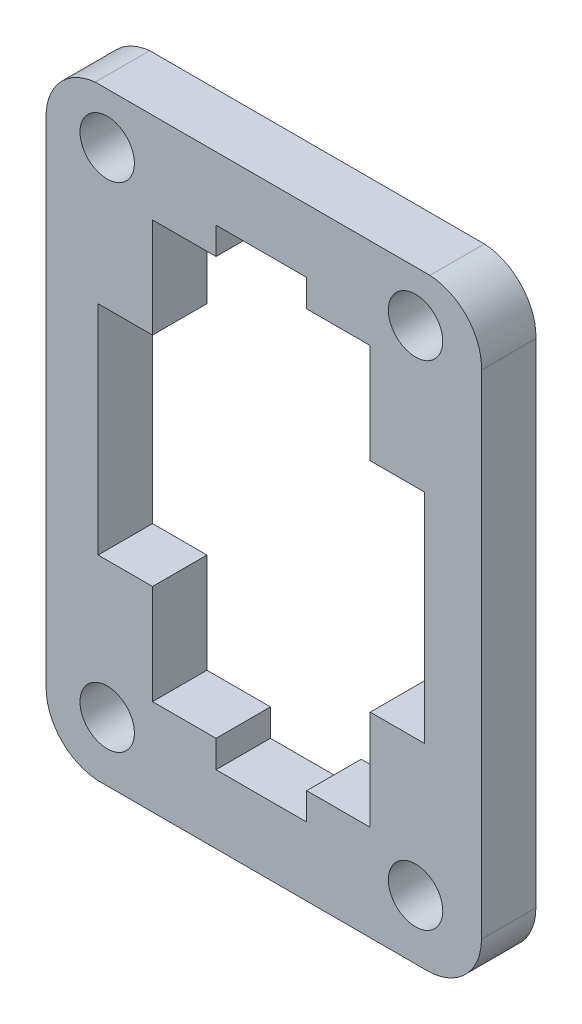
ISO-10303-21;
HEADER;
FILE_DESCRIPTION(('STEP AP214'),'2;1');
FILE_NAME('part.step','',(''),(''),'','','');
FILE_SCHEMA(('AUTOMOTIVE_DESIGN { 1 0 10303 214 1 1 1 1 }'));
ENDSEC;
DATA;
#1=APPLICATION_CONTEXT('core data for automotive mechanical design processes');
#2=APPLICATION_PROTOCOL_DEFINITION('international standard','automotive_design',2000,#1);
#3=PRODUCT_CONTEXT('',#1,'mechanical');
#4=PRODUCT('Part','Part','',(#3));
#5=PRODUCT_RELATED_PRODUCT_CATEGORY('part','',(#4));
#6=PRODUCT_DEFINITION_FORMATION('','',#4);
#7=PRODUCT_DEFINITION_CONTEXT('part definition',#1,'design');
#8=PRODUCT_DEFINITION('design','',#6,#7);
#9=PRODUCT_DEFINITION_SHAPE('','',#8);
#10=(LENGTH_UNIT() NAMED_UNIT(*) SI_UNIT(.MILLI.,.METRE.));
#11=(NAMED_UNIT(*) PLANE_ANGLE_UNIT() SI_UNIT($,.RADIAN.));
#12=(NAMED_UNIT(*) SI_UNIT($,.STERADIAN.) SOLID_ANGLE_UNIT());
#13=UNCERTAINTY_MEASURE_WITH_UNIT(LENGTH_MEASURE(1.E-05),#10,'distance_accuracy_value','');
#14=(GEOMETRIC_REPRESENTATION_CONTEXT(3) GLOBAL_UNCERTAINTY_ASSIGNED_CONTEXT((#13)) GLOBAL_UNIT_ASSIGNED_CONTEXT((#10,
#11,#12)) REPRESENTATION_CONTEXT('',''));
#15=CARTESIAN_POINT('',(0.,0.,0.));
#16=DIRECTION('',(0.,0.,1.));
#17=DIRECTION('',(1.,0.,0.));
#18=AXIS2_PLACEMENT_3D('',#15,#16,#17);
#19=CARTESIAN_POINT('',(41.133407433451,27.2260168239885,3.));
#20=CARTESIAN_POINT('',(41.133407433451,26.4304168239885,3.));
#21=CARTESIAN_POINT('',(41.449407433451,25.6674168239885,3.));
#22=CARTESIAN_POINT('',(42.012007433451,25.1048168239885,3.));
#23=B_SPLINE_CURVE_WITH_KNOTS('',3,(#19,#20,#21,#22),.UNSPECIFIED.,.F.,.F.,(4,4),(0.,
0.333333333333333),.UNSPECIFIED.);
#24=DIRECTION('',(0.,0.,-1.));
#25=VECTOR('',#24,1.);
#26=SURFACE_OF_LINEAR_EXTRUSION('',#23,#25);
#27=CARTESIAN_POINT('',(41.133407433451,27.2260168239885,0.));
#28=CARTESIAN_POINT('',(41.133407433451,26.4304168239885,0.));
#29=CARTESIAN_POINT('',(41.449407433451,25.6674168239885,0.));
#30=CARTESIAN_POINT('',(42.012007433451,25.1048168239885,0.));
#31=B_SPLINE_CURVE_WITH_KNOTS('',3,(#27,#28,#29,#30),.UNSPECIFIED.,.F.,.F.,(4,4),(0.,
0.333333333333333),.UNSPECIFIED.);
#32=CARTESIAN_POINT('',(41.133407433451,27.2260168239885,0.));
#33=VERTEX_POINT('',#32);
#34=CARTESIAN_POINT('',(42.012007433451,25.1048168239885,0.));
#35=VERTEX_POINT('',#34);
#36=EDGE_CURVE('E335',#33,#35,#31,.T.);
#37=ORIENTED_EDGE('',*,*,#36,.T.);
#38=DIRECTION('',(0.,0.,-1.));
#39=VECTOR('',#38,1.);
#40=CARTESIAN_POINT('',(42.012007433451,25.1048168239885,3.));
#41=LINE('',#40,#39);
#42=CARTESIAN_POINT('',(42.012007433451,25.1048168239885,3.));
#43=VERTEX_POINT('',#42);
#44=EDGE_CURVE('E11',#43,#35,#41,.T.);
#45=ORIENTED_EDGE('',*,*,#44,.F.);
#46=CARTESIAN_POINT('',(41.133407433451,27.2260168239885,3.));
#47=VERTEX_POINT('',#46);
#48=EDGE_CURVE('E565',#47,#43,#23,.T.);
#49=ORIENTED_EDGE('',*,*,#48,.F.);
#50=DIRECTION('',(0.,0.,-1.));
#51=VECTOR('',#50,1.);
#52=CARTESIAN_POINT('',(41.133407433451,27.2260168239885,3.));
#53=LINE('',#52,#51);
#54=EDGE_CURVE('E365',#47,#33,#53,.T.);
#55=ORIENTED_EDGE('',*,*,#54,.T.);
#56=EDGE_LOOP('',(#37,#45,#49,#55));
#57=FACE_BOUND('',#56,.T.);
#58=ADVANCED_FACE('F35',(#57),#26,.F.);
#59=CARTESIAN_POINT('',(42.012007433451,25.1048168239885,3.));
#60=CARTESIAN_POINT('',(42.574607433451,24.5422168239885,3.));
#61=CARTESIAN_POINT('',(43.3377074334511,24.2260168239885,3.));
#62=CARTESIAN_POINT('',(44.133407433451,24.2260168239884,3.));
#63=B_SPLINE_CURVE_WITH_KNOTS('',3,(#59,#60,#61,#62),.UNSPECIFIED.,.F.,.F.,(4,4),
(0.333333333333333,1.),.UNSPECIFIED.);
#64=DIRECTION('',(0.,0.,-1.));
#65=VECTOR('',#64,1.);
#66=SURFACE_OF_LINEAR_EXTRUSION('',#63,#65);
#67=CARTESIAN_POINT('',(42.012007433451,25.1048168239885,0.));
#68=CARTESIAN_POINT('',(42.574607433451,24.5422168239885,0.));
#69=CARTESIAN_POINT('',(43.3377074334511,24.2260168239885,0.));
#70=CARTESIAN_POINT('',(44.133407433451,24.2260168239884,0.));
#71=B_SPLINE_CURVE_WITH_KNOTS('',3,(#67,#68,#69,#70),.UNSPECIFIED.,.F.,.F.,(4,4),
(0.333333333333333,1.),.UNSPECIFIED.);
#72=CARTESIAN_POINT('',(44.133407433451,24.2260168239884,0.));
#73=VERTEX_POINT('',#72);
#74=EDGE_CURVE('E340',#35,#73,#71,.T.);
#75=ORIENTED_EDGE('',*,*,#74,.T.);
#76=DIRECTION('',(0.,0.,-1.));
#77=VECTOR('',#76,1.);
#78=CARTESIAN_POINT('',(44.133407433451,24.2260168239884,3.));
#79=LINE('',#78,#77);
#80=CARTESIAN_POINT('',(44.133407433451,24.2260168239884,3.));
#81=VERTEX_POINT('',#80);
#82=EDGE_CURVE('E45',#81,#73,#79,.T.);
#83=ORIENTED_EDGE('',*,*,#82,.F.);
#84=EDGE_CURVE('E570',#43,#81,#63,.T.);
#85=ORIENTED_EDGE('',*,*,#84,.F.);
#86=ORIENTED_EDGE('',*,*,#44,.T.);
#87=EDGE_LOOP('',(#75,#83,#85,#86));
#88=FACE_BOUND('',#87,.T.);
#89=ADVANCED_FACE('F582',(#88),#66,.F.);
#90=CARTESIAN_POINT('',(0.,24.2260168239884,3.));
#91=DIRECTION('',(0.,1.,0.));
#92=DIRECTION('',(0.,0.,1.));
#93=AXIS2_PLACEMENT_3D('',#90,#91,#92);
#94=PLANE('',#93);
#95=DIRECTION('',(1.,0.,0.));
#96=VECTOR('',#95,1.);
#97=CARTESIAN_POINT('',(0.,24.2260168239884,0.));
#98=LINE('',#97,#96);
#99=CARTESIAN_POINT('',(62.133207433451,24.2260168239884,0.));
#100=VERTEX_POINT('',#99);
#101=EDGE_CURVE('E347',#73,#100,#98,.T.);
#102=ORIENTED_EDGE('',*,*,#101,.T.);
#103=DIRECTION('',(0.,0.,-1.));
#104=VECTOR('',#103,1.);
#105=CARTESIAN_POINT('',(62.133207433451,24.2260168239884,3.));
#106=LINE('',#105,#104);
#107=CARTESIAN_POINT('',(62.133207433451,24.2260168239884,3.));
#108=VERTEX_POINT('',#107);
#109=EDGE_CURVE('E373',#108,#100,#106,.T.);
#110=ORIENTED_EDGE('',*,*,#109,.F.);
#111=DIRECTION('',(1.,0.,0.));
#112=VECTOR('',#111,1.);
#113=CARTESIAN_POINT('',(0.,24.2260168239884,3.));
#114=LINE('',#113,#112);
#115=EDGE_CURVE('E683',#81,#108,#114,.T.);
#116=ORIENTED_EDGE('',*,*,#115,.F.);
#117=ORIENTED_EDGE('',*,*,#82,.T.);
#118=EDGE_LOOP('',(#102,#110,#116,#117));
#119=FACE_BOUND('',#118,.T.);
#120=ADVANCED_FACE('F662',(#119),#94,.F.);
#121=CARTESIAN_POINT('',(62.132967244316,27.2262570131234,3.));
#122=DIRECTION('',(0.,0.,-1.));
#123=DIRECTION('',(-1.,0.,0.));
#124=AXIS2_PLACEMENT_3D('',#121,#122,#123);
#125=CYLINDRICAL_SURFACE('',#124,3.00024019874933);
#126=CARTESIAN_POINT('',(62.132967244316,27.2262570131234,0.));
#127=DIRECTION('',(0.,0.,1.));
#128=DIRECTION('',(1.,0.,0.));
#129=AXIS2_PLACEMENT_3D('',#126,#127,#128);
#130=CIRCLE('',#129,3.00024019874933);
#131=CARTESIAN_POINT('',(65.1332074334509,27.2260168239886,0.));
#132=VERTEX_POINT('',#131);
#133=EDGE_CURVE('E352',#100,#132,#130,.T.);
#134=ORIENTED_EDGE('',*,*,#133,.T.);
#135=DIRECTION('',(0.,0.,-1.));
#136=VECTOR('',#135,1.);
#137=CARTESIAN_POINT('',(65.1332074334509,27.2260168239886,3.));
#138=LINE('',#137,#136);
#139=CARTESIAN_POINT('',(65.1332074334509,27.2260168239886,3.));
#140=VERTEX_POINT('',#139);
#141=EDGE_CURVE('E371',#140,#132,#138,.T.);
#142=ORIENTED_EDGE('',*,*,#141,.F.);
#143=CARTESIAN_POINT('',(62.132967244316,27.2262570131234,3.));
#144=DIRECTION('',(0.,0.,1.));
#145=DIRECTION('',(1.,0.,0.));
#146=AXIS2_PLACEMENT_3D('',#143,#144,#145);
#147=CIRCLE('',#146,3.00024019874933);
#148=EDGE_CURVE('E678',#108,#140,#147,.T.);
#149=ORIENTED_EDGE('',*,*,#148,.F.);
#150=ORIENTED_EDGE('',*,*,#109,.T.);
#151=EDGE_LOOP('',(#134,#142,#149,#150));
#152=FACE_BOUND('',#151,.T.);
#153=ADVANCED_FACE('F659',(#152),#125,.T.);
#154=CARTESIAN_POINT('',(65.1332074334509,0.,3.));
#155=DIRECTION('',(1.,0.,0.));
#156=DIRECTION('',(0.,0.,-1.));
#157=AXIS2_PLACEMENT_3D('',#154,#155,#156);
#158=PLANE('',#157);
#159=DIRECTION('',(0.,-1.,0.));
#160=VECTOR('',#159,1.);
#161=CARTESIAN_POINT('',(65.1332074334509,0.,0.));
#162=LINE('',#161,#160);
#163=CARTESIAN_POINT('',(65.1332074334509,54.3971603978449,0.));
#164=VERTEX_POINT('',#163);
#165=EDGE_CURVE('E355',#164,#132,#162,.T.);
#166=ORIENTED_EDGE('',*,*,#165,.F.);
#167=DIRECTION('',(0.,0.,-1.));
#168=VECTOR('',#167,1.);
#169=CARTESIAN_POINT('',(65.1332074334509,54.3971603978449,3.));
#170=LINE('',#169,#168);
#171=CARTESIAN_POINT('',(65.1332074334509,54.3971603978449,3.));
#172=VERTEX_POINT('',#171);
#173=EDGE_CURVE('E369',#172,#164,#170,.T.);
#174=ORIENTED_EDGE('',*,*,#173,.F.);
#175=DIRECTION('',(0.,-1.,0.));
#176=VECTOR('',#175,1.);
#177=CARTESIAN_POINT('',(65.1332074334509,0.,3.));
#178=LINE('',#177,#176);
#179=EDGE_CURVE('E257',#172,#140,#178,.T.);
#180=ORIENTED_EDGE('',*,*,#179,.T.);
#181=ORIENTED_EDGE('',*,*,#141,.T.);
#182=EDGE_LOOP('',(#166,#174,#180,#181));
#183=FACE_BOUND('',#182,.T.);
#184=ADVANCED_FACE('F655',(#183),#158,.T.);
#185=CARTESIAN_POINT('',(62.1352441497047,54.5042374493222,3.));
#186=DIRECTION('',(0.,0.,-1.));
#187=DIRECTION('',(-1.,0.,0.));
#188=AXIS2_PLACEMENT_3D('',#185,#186,#187);
#189=CYLINDRICAL_SURFACE('',#188,2.9998748883318);
#190=CARTESIAN_POINT('',(62.1352441497047,54.5042374493222,0.));
#191=DIRECTION('',(0.,0.,1.));
#192=DIRECTION('',(1.,0.,0.));
#193=AXIS2_PLACEMENT_3D('',#190,#191,#192);
#194=CIRCLE('',#193,2.9998748883318);
#195=CARTESIAN_POINT('',(62.2922667162578,57.4999999998654,0.));
#196=VERTEX_POINT('',#195);
#197=EDGE_CURVE('E358',#164,#196,#194,.T.);
#198=ORIENTED_EDGE('',*,*,#197,.T.);
#199=DIRECTION('',(0.,0.,-1.));
#200=VECTOR('',#199,1.);
#201=CARTESIAN_POINT('',(62.2922667162578,57.4999999998654,3.));
#202=LINE('',#201,#200);
#203=CARTESIAN_POINT('',(62.2922667162578,57.4999999998654,3.));
#204=VERTEX_POINT('',#203);
#205=EDGE_CURVE('E245',#204,#196,#202,.T.);
#206=ORIENTED_EDGE('',*,*,#205,.F.);
#207=CARTESIAN_POINT('',(62.1352441497047,54.5042374493222,3.));
#208=DIRECTION('',(0.,0.,1.));
#209=DIRECTION('',(1.,0.,0.));
#210=AXIS2_PLACEMENT_3D('',#207,#208,#209);
#211=CIRCLE('',#210,2.9998748883318);
#212=EDGE_CURVE('E254',#172,#204,#211,.T.);
#213=ORIENTED_EDGE('',*,*,#212,.F.);
#214=ORIENTED_EDGE('',*,*,#173,.T.);
#215=EDGE_LOOP('',(#198,#206,#213,#214));
#216=FACE_BOUND('',#215,.T.);
#217=ADVANCED_FACE('F648',(#216),#189,.T.);
#218=CARTESIAN_POINT('',(0.,57.4999999998654,3.));
#219=DIRECTION('',(0.,1.,0.));
#220=DIRECTION('',(0.,0.,1.));
#221=AXIS2_PLACEMENT_3D('',#218,#219,#220);
#222=PLANE('',#221);
#223=DIRECTION('',(1.,0.,0.));
#224=VECTOR('',#223,1.);
#225=CARTESIAN_POINT('',(0.,57.4999999998654,0.));
#226=LINE('',#225,#224);
#227=CARTESIAN_POINT('',(43.8430184967902,57.4999999998654,0.));
#228=VERTEX_POINT('',#227);
#229=EDGE_CURVE('E244',#228,#196,#226,.T.);
#230=ORIENTED_EDGE('',*,*,#229,.F.);
#231=DIRECTION('',(0.,0.,-1.));
#232=VECTOR('',#231,1.);
#233=CARTESIAN_POINT('',(43.8430184967902,57.4999999998654,3.));
#234=LINE('',#233,#232);
#235=CARTESIAN_POINT('',(43.8430184967902,57.4999999998654,3.));
#236=VERTEX_POINT('',#235);
#237=EDGE_CURVE('E238',#236,#228,#234,.T.);
#238=ORIENTED_EDGE('',*,*,#237,.F.);
#239=DIRECTION('',(1.,0.,0.));
#240=VECTOR('',#239,1.);
#241=CARTESIAN_POINT('',(0.,57.4999999998654,3.));
#242=LINE('',#241,#240);
#243=EDGE_CURVE('E242',#236,#204,#242,.T.);
#244=ORIENTED_EDGE('',*,*,#243,.T.);
#245=ORIENTED_EDGE('',*,*,#205,.T.);
#246=EDGE_LOOP('',(#230,#238,#244,#245));
#247=FACE_BOUND('',#246,.T.);
#248=ADVANCED_FACE('F240',(#247),#222,.T.);
#249=CARTESIAN_POINT('',(44.1304333986134,54.5139253156263,3.));
#250=DIRECTION('',(0.,0.,-1.));
#251=DIRECTION('',(-1.,0.,0.));
#252=AXIS2_PLACEMENT_3D('',#249,#250,#251);
#253=CYLINDRICAL_SURFACE('',#252,2.9998748883318);
#254=CARTESIAN_POINT('',(44.1304333986134,54.5139253156263,0.));
#255=DIRECTION('',(0.,0.,1.));
#256=DIRECTION('',(1.,0.,0.));
#257=AXIS2_PLACEMENT_3D('',#254,#255,#256);
#258=CIRCLE('',#257,2.9998748883318);
#259=CARTESIAN_POINT('',(41.133407433451,54.3832168239885,0.));
#260=VERTEX_POINT('',#259);
#261=EDGE_CURVE('E145',#228,#260,#258,.T.);
#262=ORIENTED_EDGE('',*,*,#261,.T.);
#263=DIRECTION('',(0.,0.,-1.));
#264=VECTOR('',#263,1.);
#265=CARTESIAN_POINT('',(41.133407433451,54.3832168239885,3.));
#266=LINE('',#265,#264);
#267=CARTESIAN_POINT('',(41.133407433451,54.3832168239885,3.));
#268=VERTEX_POINT('',#267);
#269=EDGE_CURVE('E246',#268,#260,#266,.T.);
#270=ORIENTED_EDGE('',*,*,#269,.F.);
#271=CARTESIAN_POINT('',(44.1304333986134,54.5139253156263,3.));
#272=DIRECTION('',(0.,0.,1.));
#273=DIRECTION('',(1.,0.,0.));
#274=AXIS2_PLACEMENT_3D('',#271,#272,#273);
#275=CIRCLE('',#274,2.9998748883318);
#276=EDGE_CURVE('E248',#236,#268,#275,.T.);
#277=ORIENTED_EDGE('',*,*,#276,.F.);
#278=ORIENTED_EDGE('',*,*,#237,.T.);
#279=EDGE_LOOP('',(#262,#270,#277,#278));
#280=FACE_BOUND('',#279,.T.);
#281=ADVANCED_FACE('F249',(#280),#253,.T.);
#282=CARTESIAN_POINT('',(55.499899999996,-4.10781778962595E-12,3.));
#283=DIRECTION('',(-1.,0.,0.));
#284=DIRECTION('',(0.,-1.,0.));
#285=AXIS2_PLACEMENT_3D('',#282,#283,#284);
#286=PLANE('',#285);
#287=DIRECTION('',(0.,1.,0.));
#288=VECTOR('',#287,1.);
#289=CARTESIAN_POINT('',(55.499899999996,-4.10781778962595E-12,0.));
#290=LINE('',#289,#288);
#291=CARTESIAN_POINT('',(55.4998999999999,52.4999999998654,0.));
#292=VERTEX_POINT('',#291);
#293=CARTESIAN_POINT('',(55.4999,53.9999999998654,0.));
#294=VERTEX_POINT('',#293);
#295=EDGE_CURVE('E263',#292,#294,#290,.T.);
#296=ORIENTED_EDGE('',*,*,#295,.F.);
#297=DIRECTION('',(0.,0.,-1.));
#298=VECTOR('',#297,1.);
#299=CARTESIAN_POINT('',(55.4998999999999,52.4999999998654,3.));
#300=LINE('',#299,#298);
#301=CARTESIAN_POINT('',(55.4998999999999,52.4999999998654,3.));
#302=VERTEX_POINT('',#301);
#303=EDGE_CURVE('E39',#302,#292,#300,.T.);
#304=ORIENTED_EDGE('',*,*,#303,.F.);
#305=DIRECTION('',(0.,1.,0.));
#306=VECTOR('',#305,1.);
#307=CARTESIAN_POINT('',(55.499899999996,-4.10781778962595E-12,3.));
#308=LINE('',#307,#306);
#309=CARTESIAN_POINT('',(55.4999,53.9999999998654,3.));
#310=VERTEX_POINT('',#309);
#311=EDGE_CURVE('E364',#302,#310,#308,.T.);
#312=ORIENTED_EDGE('',*,*,#311,.T.);
#313=DIRECTION('',(0.,0.,-1.));
#314=VECTOR('',#313,1.);
#315=CARTESIAN_POINT('',(55.4999,53.9999999998654,3.));
#316=LINE('',#315,#314);
#317=EDGE_CURVE('E262',#310,#294,#316,.T.);
#318=ORIENTED_EDGE('',*,*,#317,.T.);
#319=EDGE_LOOP('',(#296,#304,#312,#318));
#320=FACE_BOUND('',#319,.T.);
#321=ADVANCED_FACE('F37',(#320),#286,.T.);
#322=CARTESIAN_POINT('',(0.,52.4999999998654,3.));
#323=DIRECTION('',(0.,1.,0.));
#324=DIRECTION('',(0.,0.,1.));
#325=AXIS2_PLACEMENT_3D('',#322,#323,#324);
#326=PLANE('',#325);
#327=DIRECTION('',(1.,0.,0.));
#328=VECTOR('',#327,1.);
#329=CARTESIAN_POINT('',(0.,52.4999999998654,0.));
#330=LINE('',#329,#328);
#331=CARTESIAN_POINT('',(58.9999,52.4999999998654,0.));
#332=VERTEX_POINT('',#331);
#333=EDGE_CURVE('E266',#292,#332,#330,.T.);
#334=ORIENTED_EDGE('',*,*,#333,.T.);
#335=DIRECTION('',(0.,0.,-1.));
#336=VECTOR('',#335,1.);
#337=CARTESIAN_POINT('',(58.9999,52.4999999998654,3.));
#338=LINE('',#337,#336);
#339=CARTESIAN_POINT('',(58.9999,52.4999999998654,3.));
#340=VERTEX_POINT('',#339);
#341=EDGE_CURVE('E412',#340,#332,#338,.T.);
#342=ORIENTED_EDGE('',*,*,#341,.F.);
#343=DIRECTION('',(1.,0.,0.));
#344=VECTOR('',#343,1.);
#345=CARTESIAN_POINT('',(0.,52.4999999998654,3.));
#346=LINE('',#345,#344);
#347=EDGE_CURVE('E420',#302,#340,#346,.T.);
#348=ORIENTED_EDGE('',*,*,#347,.F.);
#349=ORIENTED_EDGE('',*,*,#303,.T.);
#350=EDGE_LOOP('',(#334,#342,#348,#349));
#351=FACE_BOUND('',#350,.T.);
#352=ADVANCED_FACE('F419',(#351),#326,.F.);
#353=CARTESIAN_POINT('',(58.9999,0.,3.));
#354=DIRECTION('',(-1.,0.,0.));
#355=DIRECTION('',(0.,0.,1.));
#356=AXIS2_PLACEMENT_3D('',#353,#354,#355);
#357=PLANE('',#356);
#358=DIRECTION('',(0.,1.,0.));
#359=VECTOR('',#358,1.);
#360=CARTESIAN_POINT('',(58.9999,0.,0.));
#361=LINE('',#360,#359);
#362=CARTESIAN_POINT('',(58.9999,46.9999999998654,0.));
#363=VERTEX_POINT('',#362);
#364=EDGE_CURVE('E269',#363,#332,#361,.T.);
#365=ORIENTED_EDGE('',*,*,#364,.F.);
#366=DIRECTION('',(0.,0.,-1.));
#367=VECTOR('',#366,1.);
#368=CARTESIAN_POINT('',(58.9999,46.9999999998654,3.));
#369=LINE('',#368,#367);
#370=CARTESIAN_POINT('',(58.9999,46.9999999998654,3.));
#371=VERTEX_POINT('',#370);
#372=EDGE_CURVE('E411',#371,#363,#369,.T.);
#373=ORIENTED_EDGE('',*,*,#372,.F.);
#374=DIRECTION('',(0.,1.,0.));
#375=VECTOR('',#374,1.);
#376=CARTESIAN_POINT('',(58.9999,0.,3.));
#377=LINE('',#376,#375);
#378=EDGE_CURVE('E520',#371,#340,#377,.T.);
#379=ORIENTED_EDGE('',*,*,#378,.T.);
#380=ORIENTED_EDGE('',*,*,#341,.T.);
#381=EDGE_LOOP('',(#365,#373,#379,#380));
#382=FACE_BOUND('',#381,.T.);
#383=ADVANCED_FACE('F518',(#382),#357,.T.);
#384=CARTESIAN_POINT('',(0.,46.9999999998654,3.));
#385=DIRECTION('',(0.,1.,0.));
#386=DIRECTION('',(0.,0.,1.));
#387=AXIS2_PLACEMENT_3D('',#384,#385,#386);
#388=PLANE('',#387);
#389=DIRECTION('',(1.,0.,0.));
#390=VECTOR('',#389,1.);
#391=CARTESIAN_POINT('',(0.,46.9999999998654,0.));
#392=LINE('',#391,#390);
#393=CARTESIAN_POINT('',(61.9999,46.9999999998654,0.));
#394=VERTEX_POINT('',#393);
#395=EDGE_CURVE('E272',#363,#394,#392,.T.);
#396=ORIENTED_EDGE('',*,*,#395,.T.);
#397=DIRECTION('',(0.,0.,-1.));
#398=VECTOR('',#397,1.);
#399=CARTESIAN_POINT('',(61.9999,46.9999999998654,3.));
#400=LINE('',#399,#398);
#401=CARTESIAN_POINT('',(61.9999,46.9999999998654,3.));
#402=VERTEX_POINT('',#401);
#403=EDGE_CURVE('E409',#402,#394,#400,.T.);
#404=ORIENTED_EDGE('',*,*,#403,.F.);
#405=DIRECTION('',(1.,0.,0.));
#406=VECTOR('',#405,1.);
#407=CARTESIAN_POINT('',(0.,46.9999999998654,3.));
#408=LINE('',#407,#406);
#409=EDGE_CURVE('E521',#371,#402,#408,.T.);
#410=ORIENTED_EDGE('',*,*,#409,.F.);
#411=ORIENTED_EDGE('',*,*,#372,.T.);
#412=EDGE_LOOP('',(#396,#404,#410,#411));
#413=FACE_BOUND('',#412,.T.);
#414=ADVANCED_FACE('F517',(#413),#388,.F.);
#415=CARTESIAN_POINT('',(61.9999,0.,3.));
#416=DIRECTION('',(-1.,0.,0.));
#417=DIRECTION('',(0.,0.,1.));
#418=AXIS2_PLACEMENT_3D('',#415,#416,#417);
#419=PLANE('',#418);
#420=DIRECTION('',(0.,1.,0.));
#421=VECTOR('',#420,1.);
#422=CARTESIAN_POINT('',(61.9999,0.,0.));
#423=LINE('',#422,#421);
#424=CARTESIAN_POINT('',(61.9999,34.9999999998654,0.));
#425=VERTEX_POINT('',#424);
#426=EDGE_CURVE('E275',#425,#394,#423,.T.);
#427=ORIENTED_EDGE('',*,*,#426,.F.);
#428=DIRECTION('',(0.,0.,-1.));
#429=VECTOR('',#428,1.);
#430=CARTESIAN_POINT('',(61.9999,34.9999999998654,3.));
#431=LINE('',#430,#429);
#432=CARTESIAN_POINT('',(61.9999,34.9999999998654,3.));
#433=VERTEX_POINT('',#432);
#434=EDGE_CURVE('E407',#433,#425,#431,.T.);
#435=ORIENTED_EDGE('',*,*,#434,.F.);
#436=DIRECTION('',(0.,1.,0.));
#437=VECTOR('',#436,1.);
#438=CARTESIAN_POINT('',(61.9999,0.,3.));
#439=LINE('',#438,#437);
#440=EDGE_CURVE('E514',#433,#402,#439,.T.);
#441=ORIENTED_EDGE('',*,*,#440,.T.);
#442=ORIENTED_EDGE('',*,*,#403,.T.);
#443=EDGE_LOOP('',(#427,#435,#441,#442));
#444=FACE_BOUND('',#443,.T.);
#445=ADVANCED_FACE('F510',(#444),#419,.T.);
#446=CARTESIAN_POINT('',(1.13335267096722E-12,34.9999999998674,3.));
#447=DIRECTION('',(0.,-1.,0.));
#448=DIRECTION('',(1.,0.,0.));
#449=AXIS2_PLACEMENT_3D('',#446,#447,#448);
#450=PLANE('',#449);
#451=DIRECTION('',(-1.,0.,0.));
#452=VECTOR('',#451,1.);
#453=CARTESIAN_POINT('',(1.13335267096722E-12,34.9999999998674,0.));
#454=LINE('',#453,#452);
#455=CARTESIAN_POINT('',(58.9999,34.9999999998655,0.));
#456=VERTEX_POINT('',#455);
#457=EDGE_CURVE('E278',#425,#456,#454,.T.);
#458=ORIENTED_EDGE('',*,*,#457,.T.);
#459=DIRECTION('',(0.,0.,-1.));
#460=VECTOR('',#459,1.);
#461=CARTESIAN_POINT('',(58.9999,34.9999999998655,3.));
#462=LINE('',#461,#460);
#463=CARTESIAN_POINT('',(58.9999,34.9999999998655,3.));
#464=VERTEX_POINT('',#463);
#465=EDGE_CURVE('E405',#464,#456,#462,.T.);
#466=ORIENTED_EDGE('',*,*,#465,.F.);
#467=DIRECTION('',(-1.,0.,0.));
#468=VECTOR('',#467,1.);
#469=CARTESIAN_POINT('',(1.13335267096722E-12,34.9999999998674,3.));
#470=LINE('',#469,#468);
#471=EDGE_CURVE('E530',#433,#464,#470,.T.);
#472=ORIENTED_EDGE('',*,*,#471,.F.);
#473=ORIENTED_EDGE('',*,*,#434,.T.);
#474=EDGE_LOOP('',(#458,#466,#472,#473));
#475=FACE_BOUND('',#474,.T.);
#476=ADVANCED_FACE('F507',(#475),#450,.F.);
#477=CARTESIAN_POINT('',(58.9999,0.,3.));
#478=DIRECTION('',(-1.,0.,0.));
#479=DIRECTION('',(0.,0.,1.));
#480=AXIS2_PLACEMENT_3D('',#477,#478,#479);
#481=PLANE('',#480);
#482=DIRECTION('',(0.,1.,0.));
#483=VECTOR('',#482,1.);
#484=CARTESIAN_POINT('',(58.9999,0.,0.));
#485=LINE('',#484,#483);
#486=CARTESIAN_POINT('',(58.9999,29.4999999998654,0.));
#487=VERTEX_POINT('',#486);
#488=EDGE_CURVE('E281',#487,#456,#485,.T.);
#489=ORIENTED_EDGE('',*,*,#488,.F.);
#490=DIRECTION('',(0.,0.,-1.));
#491=VECTOR('',#490,1.);
#492=CARTESIAN_POINT('',(58.9999,29.4999999998654,3.));
#493=LINE('',#492,#491);
#494=CARTESIAN_POINT('',(58.9999,29.4999999998654,3.));
#495=VERTEX_POINT('',#494);
#496=EDGE_CURVE('E403',#495,#487,#493,.T.);
#497=ORIENTED_EDGE('',*,*,#496,.F.);
#498=DIRECTION('',(0.,1.,0.));
#499=VECTOR('',#498,1.);
#500=CARTESIAN_POINT('',(58.9999,0.,3.));
#501=LINE('',#500,#499);
#502=EDGE_CURVE('E504',#495,#464,#501,.T.);
#503=ORIENTED_EDGE('',*,*,#502,.T.);
#504=ORIENTED_EDGE('',*,*,#465,.T.);
#505=EDGE_LOOP('',(#489,#497,#503,#504));
#506=FACE_BOUND('',#505,.T.);
#507=ADVANCED_FACE('F500',(#506),#481,.T.);
#508=CARTESIAN_POINT('',(0.,29.4999999998654,3.));
#509=DIRECTION('',(0.,-1.,0.));
#510=DIRECTION('',(0.,0.,-1.));
#511=AXIS2_PLACEMENT_3D('',#508,#509,#510);
#512=PLANE('',#511);
#513=DIRECTION('',(-1.,0.,0.));
#514=VECTOR('',#513,1.);
#515=CARTESIAN_POINT('',(0.,29.4999999998654,0.));
#516=LINE('',#515,#514);
#517=CARTESIAN_POINT('',(55.4999,29.4999999998654,0.));
#518=VERTEX_POINT('',#517);
#519=EDGE_CURVE('E284',#487,#518,#516,.T.);
#520=ORIENTED_EDGE('',*,*,#519,.T.);
#521=DIRECTION('',(0.,0.,-1.));
#522=VECTOR('',#521,1.);
#523=CARTESIAN_POINT('',(55.4999,29.4999999998654,3.));
#524=LINE('',#523,#522);
#525=CARTESIAN_POINT('',(55.4999,29.4999999998654,3.));
#526=VERTEX_POINT('',#525);
#527=EDGE_CURVE('E401',#526,#518,#524,.T.);
#528=ORIENTED_EDGE('',*,*,#527,.F.);
#529=DIRECTION('',(-1.,0.,0.));
#530=VECTOR('',#529,1.);
#531=CARTESIAN_POINT('',(0.,29.4999999998654,3.));
#532=LINE('',#531,#530);
#533=EDGE_CURVE('E533',#495,#526,#532,.T.);
#534=ORIENTED_EDGE('',*,*,#533,.F.);
#535=ORIENTED_EDGE('',*,*,#496,.T.);
#536=EDGE_LOOP('',(#520,#528,#534,#535));
#537=FACE_BOUND('',#536,.T.);
#538=ADVANCED_FACE('F496',(#537),#512,.F.);
#539=CARTESIAN_POINT('',(55.4999,0.,3.));
#540=DIRECTION('',(-1.,0.,0.));
#541=DIRECTION('',(0.,0.,1.));
#542=AXIS2_PLACEMENT_3D('',#539,#540,#541);
#543=PLANE('',#542);
#544=DIRECTION('',(0.,1.,0.));
#545=VECTOR('',#544,1.);
#546=CARTESIAN_POINT('',(55.4999,0.,0.));
#547=LINE('',#546,#545);
#548=CARTESIAN_POINT('',(55.4999,28.0000999998654,0.));
#549=VERTEX_POINT('',#548);
#550=EDGE_CURVE('E287',#549,#518,#547,.T.);
#551=ORIENTED_EDGE('',*,*,#550,.F.);
#552=DIRECTION('',(0.,0.,-1.));
#553=VECTOR('',#552,1.);
#554=CARTESIAN_POINT('',(55.4999,28.0000999998654,3.));
#555=LINE('',#554,#553);
#556=CARTESIAN_POINT('',(55.4999,28.0000999998654,3.));
#557=VERTEX_POINT('',#556);
#558=EDGE_CURVE('E399',#557,#549,#555,.T.);
#559=ORIENTED_EDGE('',*,*,#558,.F.);
#560=DIRECTION('',(0.,1.,0.));
#561=VECTOR('',#560,1.);
#562=CARTESIAN_POINT('',(55.4999,0.,3.));
#563=LINE('',#562,#561);
#564=EDGE_CURVE('E493',#557,#526,#563,.T.);
#565=ORIENTED_EDGE('',*,*,#564,.T.);
#566=ORIENTED_EDGE('',*,*,#527,.T.);
#567=EDGE_LOOP('',(#551,#559,#565,#566));
#568=FACE_BOUND('',#567,.T.);
#569=ADVANCED_FACE('F489',(#568),#543,.T.);
#570=CARTESIAN_POINT('',(0.,28.0000999998654,3.));
#571=DIRECTION('',(0.,-1.,0.));
#572=DIRECTION('',(0.,0.,-1.));
#573=AXIS2_PLACEMENT_3D('',#570,#571,#572);
#574=PLANE('',#573);
#575=DIRECTION('',(-1.,0.,0.));
#576=VECTOR('',#575,1.);
#577=CARTESIAN_POINT('',(0.,28.0000999998654,0.));
#578=LINE('',#577,#576);
#579=CARTESIAN_POINT('',(50.4999,28.0000999998654,0.));
#580=VERTEX_POINT('',#579);
#581=EDGE_CURVE('E290',#549,#580,#578,.T.);
#582=ORIENTED_EDGE('',*,*,#581,.T.);
#583=DIRECTION('',(0.,0.,-1.));
#584=VECTOR('',#583,1.);
#585=CARTESIAN_POINT('',(50.4999,28.0000999998654,3.));
#586=LINE('',#585,#584);
#587=CARTESIAN_POINT('',(50.4999,28.0000999998654,3.));
#588=VERTEX_POINT('',#587);
#589=EDGE_CURVE('E397',#588,#580,#586,.T.);
#590=ORIENTED_EDGE('',*,*,#589,.F.);
#591=DIRECTION('',(-1.,0.,0.));
#592=VECTOR('',#591,1.);
#593=CARTESIAN_POINT('',(0.,28.0000999998654,3.));
#594=LINE('',#593,#592);
#595=EDGE_CURVE('E536',#557,#588,#594,.T.);
#596=ORIENTED_EDGE('',*,*,#595,.F.);
#597=ORIENTED_EDGE('',*,*,#558,.T.);
#598=EDGE_LOOP('',(#582,#590,#596,#597));
#599=FACE_BOUND('',#598,.T.);
#600=ADVANCED_FACE('F485',(#599),#574,.F.);
#601=CARTESIAN_POINT('',(50.4999,0.,3.));
#602=DIRECTION('',(1.,0.,0.));
#603=DIRECTION('',(0.,0.,-1.));
#604=AXIS2_PLACEMENT_3D('',#601,#602,#603);
#605=PLANE('',#604);
#606=DIRECTION('',(0.,-1.,0.));
#607=VECTOR('',#606,1.);
#608=CARTESIAN_POINT('',(50.4999,0.,0.));
#609=LINE('',#608,#607);
#610=CARTESIAN_POINT('',(50.4999,29.4999999998654,0.));
#611=VERTEX_POINT('',#610);
#612=EDGE_CURVE('E293',#611,#580,#609,.T.);
#613=ORIENTED_EDGE('',*,*,#612,.F.);
#614=DIRECTION('',(0.,0.,-1.));
#615=VECTOR('',#614,1.);
#616=CARTESIAN_POINT('',(50.4999,29.4999999998654,3.));
#617=LINE('',#616,#615);
#618=CARTESIAN_POINT('',(50.4999,29.4999999998654,3.));
#619=VERTEX_POINT('',#618);
#620=EDGE_CURVE('E395',#619,#611,#617,.T.);
#621=ORIENTED_EDGE('',*,*,#620,.F.);
#622=DIRECTION('',(0.,-1.,0.));
#623=VECTOR('',#622,1.);
#624=CARTESIAN_POINT('',(50.4999,0.,3.));
#625=LINE('',#624,#623);
#626=EDGE_CURVE('E482',#619,#588,#625,.T.);
#627=ORIENTED_EDGE('',*,*,#626,.T.);
#628=ORIENTED_EDGE('',*,*,#589,.T.);
#629=EDGE_LOOP('',(#613,#621,#627,#628));
#630=FACE_BOUND('',#629,.T.);
#631=ADVANCED_FACE('F478',(#630),#605,.T.);
#632=CARTESIAN_POINT('',(-1.16969925808187E-13,29.4999999998652,3.));
#633=DIRECTION('',(0.,-1.,0.));
#634=DIRECTION('',(1.,0.,0.));
#635=AXIS2_PLACEMENT_3D('',#632,#633,#634);
#636=PLANE('',#635);
#637=DIRECTION('',(-1.,0.,0.));
#638=VECTOR('',#637,1.);
#639=CARTESIAN_POINT('',(-1.16969925808187E-13,29.4999999998652,0.));
#640=LINE('',#639,#638);
#641=CARTESIAN_POINT('',(46.9999,29.4999999998654,0.));
#642=VERTEX_POINT('',#641);
#643=EDGE_CURVE('E296',#611,#642,#640,.T.);
#644=ORIENTED_EDGE('',*,*,#643,.T.);
#645=DIRECTION('',(0.,0.,-1.));
#646=VECTOR('',#645,1.);
#647=CARTESIAN_POINT('',(46.9999,29.4999999998654,3.));
#648=LINE('',#647,#646);
#649=CARTESIAN_POINT('',(46.9999,29.4999999998654,3.));
#650=VERTEX_POINT('',#649);
#651=EDGE_CURVE('E393',#650,#642,#648,.T.);
#652=ORIENTED_EDGE('',*,*,#651,.F.);
#653=DIRECTION('',(-1.,0.,0.));
#654=VECTOR('',#653,1.);
#655=CARTESIAN_POINT('',(-1.16969925808187E-13,29.4999999998652,3.));
#656=LINE('',#655,#654);
#657=EDGE_CURVE('E539',#619,#650,#656,.T.);
#658=ORIENTED_EDGE('',*,*,#657,.F.);
#659=ORIENTED_EDGE('',*,*,#620,.T.);
#660=EDGE_LOOP('',(#644,#652,#658,#659));
#661=FACE_BOUND('',#660,.T.);
#662=ADVANCED_FACE('F474',(#661),#636,.F.);
#663=CARTESIAN_POINT('',(46.9999,0.,3.));
#664=DIRECTION('',(1.,0.,0.));
#665=DIRECTION('',(0.,0.,-1.));
#666=AXIS2_PLACEMENT_3D('',#663,#664,#665);
#667=PLANE('',#666);
#668=DIRECTION('',(0.,-1.,0.));
#669=VECTOR('',#668,1.);
#670=CARTESIAN_POINT('',(46.9999,0.,0.));
#671=LINE('',#670,#669);
#672=CARTESIAN_POINT('',(46.9999,34.9999999998654,0.));
#673=VERTEX_POINT('',#672);
#674=EDGE_CURVE('E299',#673,#642,#671,.T.);
#675=ORIENTED_EDGE('',*,*,#674,.F.);
#676=DIRECTION('',(0.,0.,-1.));
#677=VECTOR('',#676,1.);
#678=CARTESIAN_POINT('',(46.9999,34.9999999998654,3.));
#679=LINE('',#678,#677);
#680=CARTESIAN_POINT('',(46.9999,34.9999999998654,3.));
#681=VERTEX_POINT('',#680);
#682=EDGE_CURVE('E391',#681,#673,#679,.T.);
#683=ORIENTED_EDGE('',*,*,#682,.F.);
#684=DIRECTION('',(0.,-1.,0.));
#685=VECTOR('',#684,1.);
#686=CARTESIAN_POINT('',(46.9999,0.,3.));
#687=LINE('',#686,#685);
#688=EDGE_CURVE('E471',#681,#650,#687,.T.);
#689=ORIENTED_EDGE('',*,*,#688,.T.);
#690=ORIENTED_EDGE('',*,*,#651,.T.);
#691=EDGE_LOOP('',(#675,#683,#689,#690));
#692=FACE_BOUND('',#691,.T.);
#693=ADVANCED_FACE('F467',(#692),#667,.T.);
#694=CARTESIAN_POINT('',(0.,34.9999999998654,3.));
#695=DIRECTION('',(0.,-1.,0.));
#696=DIRECTION('',(0.,0.,-1.));
#697=AXIS2_PLACEMENT_3D('',#694,#695,#696);
#698=PLANE('',#697);
#699=DIRECTION('',(-1.,0.,0.));
#700=VECTOR('',#699,1.);
#701=CARTESIAN_POINT('',(0.,34.9999999998654,0.));
#702=LINE('',#701,#700);
#703=CARTESIAN_POINT('',(44.0001,34.9999999998654,0.));
#704=VERTEX_POINT('',#703);
#705=EDGE_CURVE('E302',#673,#704,#702,.T.);
#706=ORIENTED_EDGE('',*,*,#705,.T.);
#707=DIRECTION('',(0.,0.,-1.));
#708=VECTOR('',#707,1.);
#709=CARTESIAN_POINT('',(44.0001,34.9999999998654,3.));
#710=LINE('',#709,#708);
#711=CARTESIAN_POINT('',(44.0001,34.9999999998654,3.));
#712=VERTEX_POINT('',#711);
#713=EDGE_CURVE('E389',#712,#704,#710,.T.);
#714=ORIENTED_EDGE('',*,*,#713,.F.);
#715=DIRECTION('',(-1.,0.,0.));
#716=VECTOR('',#715,1.);
#717=CARTESIAN_POINT('',(0.,34.9999999998654,3.));
#718=LINE('',#717,#716);
#719=EDGE_CURVE('E542',#681,#712,#718,.T.);
#720=ORIENTED_EDGE('',*,*,#719,.F.);
#721=ORIENTED_EDGE('',*,*,#682,.T.);
#722=EDGE_LOOP('',(#706,#714,#720,#721));
#723=FACE_BOUND('',#722,.T.);
#724=ADVANCED_FACE('F463',(#723),#698,.F.);
#725=CARTESIAN_POINT('',(44.0001,0.,3.));
#726=DIRECTION('',(1.,0.,0.));
#727=DIRECTION('',(0.,0.,-1.));
#728=AXIS2_PLACEMENT_3D('',#725,#726,#727);
#729=PLANE('',#728);
#730=DIRECTION('',(0.,-1.,0.));
#731=VECTOR('',#730,1.);
#732=CARTESIAN_POINT('',(44.0001,0.,0.));
#733=LINE('',#732,#731);
#734=CARTESIAN_POINT('',(44.0001,46.9999999998654,0.));
#735=VERTEX_POINT('',#734);
#736=EDGE_CURVE('E305',#735,#704,#733,.T.);
#737=ORIENTED_EDGE('',*,*,#736,.F.);
#738=DIRECTION('',(0.,0.,-1.));
#739=VECTOR('',#738,1.);
#740=CARTESIAN_POINT('',(44.0001,46.9999999998654,3.));
#741=LINE('',#740,#739);
#742=CARTESIAN_POINT('',(44.0001,46.9999999998654,3.));
#743=VERTEX_POINT('',#742);
#744=EDGE_CURVE('E387',#743,#735,#741,.T.);
#745=ORIENTED_EDGE('',*,*,#744,.F.);
#746=DIRECTION('',(0.,-1.,0.));
#747=VECTOR('',#746,1.);
#748=CARTESIAN_POINT('',(44.0001,0.,3.));
#749=LINE('',#748,#747);
#750=EDGE_CURVE('E460',#743,#712,#749,.T.);
#751=ORIENTED_EDGE('',*,*,#750,.T.);
#752=ORIENTED_EDGE('',*,*,#713,.T.);
#753=EDGE_LOOP('',(#737,#745,#751,#752));
#754=FACE_BOUND('',#753,.T.);
#755=ADVANCED_FACE('F456',(#754),#729,.T.);
#756=CARTESIAN_POINT('',(0.,46.9999999998654,3.));
#757=DIRECTION('',(0.,1.,0.));
#758=DIRECTION('',(0.,0.,1.));
#759=AXIS2_PLACEMENT_3D('',#756,#757,#758);
#760=PLANE('',#759);
#761=DIRECTION('',(1.,0.,0.));
#762=VECTOR('',#761,1.);
#763=CARTESIAN_POINT('',(0.,46.9999999998654,0.));
#764=LINE('',#763,#762);
#765=CARTESIAN_POINT('',(46.9999,46.9999999998654,0.));
#766=VERTEX_POINT('',#765);
#767=EDGE_CURVE('E308',#735,#766,#764,.T.);
#768=ORIENTED_EDGE('',*,*,#767,.T.);
#769=DIRECTION('',(0.,0.,-1.));
#770=VECTOR('',#769,1.);
#771=CARTESIAN_POINT('',(46.9999,46.9999999998654,3.));
#772=LINE('',#771,#770);
#773=CARTESIAN_POINT('',(46.9999,46.9999999998654,3.));
#774=VERTEX_POINT('',#773);
#775=EDGE_CURVE('E385',#774,#766,#772,.T.);
#776=ORIENTED_EDGE('',*,*,#775,.F.);
#777=DIRECTION('',(1.,0.,0.));
#778=VECTOR('',#777,1.);
#779=CARTESIAN_POINT('',(0.,46.9999999998654,3.));
#780=LINE('',#779,#778);
#781=EDGE_CURVE('E545',#743,#774,#780,.T.);
#782=ORIENTED_EDGE('',*,*,#781,.F.);
#783=ORIENTED_EDGE('',*,*,#744,.T.);
#784=EDGE_LOOP('',(#768,#776,#782,#783));
#785=FACE_BOUND('',#784,.T.);
#786=ADVANCED_FACE('F452',(#785),#760,.F.);
#787=CARTESIAN_POINT('',(46.9999,0.,3.));
#788=DIRECTION('',(1.,0.,0.));
#789=DIRECTION('',(0.,0.,-1.));
#790=AXIS2_PLACEMENT_3D('',#787,#788,#789);
#791=PLANE('',#790);
#792=DIRECTION('',(0.,-1.,0.));
#793=VECTOR('',#792,1.);
#794=CARTESIAN_POINT('',(46.9999,0.,0.));
#795=LINE('',#794,#793);
#796=CARTESIAN_POINT('',(46.9999,52.4999999998654,0.));
#797=VERTEX_POINT('',#796);
#798=EDGE_CURVE('E311',#797,#766,#795,.T.);
#799=ORIENTED_EDGE('',*,*,#798,.F.);
#800=DIRECTION('',(0.,0.,-1.));
#801=VECTOR('',#800,1.);
#802=CARTESIAN_POINT('',(46.9999,52.4999999998654,3.));
#803=LINE('',#802,#801);
#804=CARTESIAN_POINT('',(46.9999,52.4999999998654,3.));
#805=VERTEX_POINT('',#804);
#806=EDGE_CURVE('E383',#805,#797,#803,.T.);
#807=ORIENTED_EDGE('',*,*,#806,.F.);
#808=DIRECTION('',(0.,-1.,0.));
#809=VECTOR('',#808,1.);
#810=CARTESIAN_POINT('',(46.9999,0.,3.));
#811=LINE('',#810,#809);
#812=EDGE_CURVE('E449',#805,#774,#811,.T.);
#813=ORIENTED_EDGE('',*,*,#812,.T.);
#814=ORIENTED_EDGE('',*,*,#775,.T.);
#815=EDGE_LOOP('',(#799,#807,#813,#814));
#816=FACE_BOUND('',#815,.T.);
#817=ADVANCED_FACE('F445',(#816),#791,.T.);
#818=CARTESIAN_POINT('',(0.,52.4999999998654,3.));
#819=DIRECTION('',(0.,1.,0.));
#820=DIRECTION('',(0.,0.,1.));
#821=AXIS2_PLACEMENT_3D('',#818,#819,#820);
#822=PLANE('',#821);
#823=DIRECTION('',(1.,0.,0.));
#824=VECTOR('',#823,1.);
#825=CARTESIAN_POINT('',(0.,52.4999999998654,0.));
#826=LINE('',#825,#824);
#827=CARTESIAN_POINT('',(50.4999,52.4999999998654,0.));
#828=VERTEX_POINT('',#827);
#829=EDGE_CURVE('E314',#797,#828,#826,.T.);
#830=ORIENTED_EDGE('',*,*,#829,.T.);
#831=DIRECTION('',(0.,0.,-1.));
#832=VECTOR('',#831,1.);
#833=CARTESIAN_POINT('',(50.4999,52.4999999998654,3.));
#834=LINE('',#833,#832);
#835=CARTESIAN_POINT('',(50.4999,52.4999999998654,3.));
#836=VERTEX_POINT('',#835);
#837=EDGE_CURVE('E381',#836,#828,#834,.T.);
#838=ORIENTED_EDGE('',*,*,#837,.F.);
#839=DIRECTION('',(1.,0.,0.));
#840=VECTOR('',#839,1.);
#841=CARTESIAN_POINT('',(0.,52.4999999998654,3.));
#842=LINE('',#841,#840);
#843=EDGE_CURVE('E548',#805,#836,#842,.T.);
#844=ORIENTED_EDGE('',*,*,#843,.F.);
#845=ORIENTED_EDGE('',*,*,#806,.T.);
#846=EDGE_LOOP('',(#830,#838,#844,#845));
#847=FACE_BOUND('',#846,.T.);
#848=ADVANCED_FACE('F441',(#847),#822,.F.);
#849=CARTESIAN_POINT('',(50.4999,0.,3.));
#850=DIRECTION('',(1.,0.,0.));
#851=DIRECTION('',(0.,0.,-1.));
#852=AXIS2_PLACEMENT_3D('',#849,#850,#851);
#853=PLANE('',#852);
#854=DIRECTION('',(0.,-1.,0.));
#855=VECTOR('',#854,1.);
#856=CARTESIAN_POINT('',(50.4999,0.,0.));
#857=LINE('',#856,#855);
#858=CARTESIAN_POINT('',(50.4999,53.9999999998654,0.));
#859=VERTEX_POINT('',#858);
#860=EDGE_CURVE('E317',#859,#828,#857,.T.);
#861=ORIENTED_EDGE('',*,*,#860,.F.);
#862=DIRECTION('',(0.,0.,-1.));
#863=VECTOR('',#862,1.);
#864=CARTESIAN_POINT('',(50.4999,53.9999999998654,3.));
#865=LINE('',#864,#863);
#866=CARTESIAN_POINT('',(50.4999,53.9999999998654,3.));
#867=VERTEX_POINT('',#866);
#868=EDGE_CURVE('E379',#867,#859,#865,.T.);
#869=ORIENTED_EDGE('',*,*,#868,.F.);
#870=DIRECTION('',(0.,-1.,0.));
#871=VECTOR('',#870,1.);
#872=CARTESIAN_POINT('',(50.4999,0.,3.));
#873=LINE('',#872,#871);
#874=EDGE_CURVE('E438',#867,#836,#873,.T.);
#875=ORIENTED_EDGE('',*,*,#874,.T.);
#876=ORIENTED_EDGE('',*,*,#837,.T.);
#877=EDGE_LOOP('',(#861,#869,#875,#876));
#878=FACE_BOUND('',#877,.T.);
#879=ADVANCED_FACE('F434',(#878),#853,.T.);
#880=CARTESIAN_POINT('',(61.4999499966666,27.5000499965321,3.));
#881=DIRECTION('',(0.,0.,-1.));
#882=DIRECTION('',(-1.,0.,0.));
#883=AXIS2_PLACEMENT_3D('',#880,#881,#882);
#884=CYLINDRICAL_SURFACE('',#883,1.49995000416658);
#885=CARTESIAN_POINT('',(61.4999499966666,27.5000499965321,3.));
#886=DIRECTION('',(0.,0.,1.));
#887=DIRECTION('',(1.,0.,0.));
#888=AXIS2_PLACEMENT_3D('',#885,#886,#887);
#889=CIRCLE('',#888,1.49995000416658);
#890=CARTESIAN_POINT('',(62.9999000008332,27.5000499965321,3.));
#891=VERTEX_POINT('',#890);
#892=EDGE_CURVE('E562',#891,#891,#889,.T.);
#893=ORIENTED_EDGE('',*,*,#892,.T.);
#894=EDGE_LOOP('',(#893));
#895=FACE_BOUND('',#894,.T.);
#896=CARTESIAN_POINT('',(61.4999499966666,27.5000499965321,0.));
#897=DIRECTION('',(0.,0.,1.));
#898=DIRECTION('',(1.,0.,0.));
#899=AXIS2_PLACEMENT_3D('',#896,#897,#898);
#900=CIRCLE('',#899,1.49995000416658);
#901=CARTESIAN_POINT('',(62.9999000008332,27.5000499965321,0.));
#902=VERTEX_POINT('',#901);
#903=EDGE_CURVE('E332',#902,#902,#900,.T.);
#904=ORIENTED_EDGE('',*,*,#903,.F.);
#905=EDGE_LOOP('',(#904));
#906=FACE_BOUND('',#905,.T.);
#907=ADVANCED_FACE('F585',(#895,#906),#884,.F.);
#908=CARTESIAN_POINT('',(44.4998999916659,27.5000000048657,3.));
#909=DIRECTION('',(0.,0.,-1.));
#910=DIRECTION('',(-1.,0.,0.));
#911=AXIS2_PLACEMENT_3D('',#908,#909,#910);
#912=CYLINDRICAL_SURFACE('',#911,1.50000000833415);
#913=CARTESIAN_POINT('',(44.4998999916659,27.5000000048657,3.));
#914=DIRECTION('',(0.,0.,1.));
#915=DIRECTION('',(1.,0.,0.));
#916=AXIS2_PLACEMENT_3D('',#913,#914,#915);
#917=CIRCLE('',#916,1.50000000833415);
#918=CARTESIAN_POINT('',(45.9999,27.5000000048657,3.));
#919=VERTEX_POINT('',#918);
#920=EDGE_CURVE('E559',#919,#919,#917,.T.);
#921=ORIENTED_EDGE('',*,*,#920,.T.);
#922=EDGE_LOOP('',(#921));
#923=FACE_BOUND('',#922,.T.);
#924=CARTESIAN_POINT('',(44.4998999916659,27.5000000048657,0.));
#925=DIRECTION('',(0.,0.,1.));
#926=DIRECTION('',(1.,0.,0.));
#927=AXIS2_PLACEMENT_3D('',#924,#925,#926);
#928=CIRCLE('',#927,1.50000000833415);
#929=CARTESIAN_POINT('',(45.9999,27.5000000048657,0.));
#930=VERTEX_POINT('',#929);
#931=EDGE_CURVE('E329',#930,#930,#928,.T.);
#932=ORIENTED_EDGE('',*,*,#931,.F.);
#933=EDGE_LOOP('',(#932));
#934=FACE_BOUND('',#933,.T.);
#935=ADVANCED_FACE('F588',(#923,#934),#912,.F.);
#936=CARTESIAN_POINT('',(61.4999000016665,54.7000999981987,3.));
#937=DIRECTION('',(0.,0.,-1.));
#938=DIRECTION('',(-1.,0.,0.));
#939=AXIS2_PLACEMENT_3D('',#936,#937,#938);
#940=CYLINDRICAL_SURFACE('',#939,1.50000000166674);
#941=CARTESIAN_POINT('',(61.4999000016665,54.7000999981987,3.));
#942=DIRECTION('',(0.,0.,1.));
#943=DIRECTION('',(1.,0.,0.));
#944=AXIS2_PLACEMENT_3D('',#941,#942,#943);
#945=CIRCLE('',#944,1.50000000166674);
#946=CARTESIAN_POINT('',(62.9999000033332,54.7000999981987,3.));
#947=VERTEX_POINT('',#946);
#948=EDGE_CURVE('E556',#947,#947,#945,.T.);
#949=ORIENTED_EDGE('',*,*,#948,.T.);
#950=EDGE_LOOP('',(#949));
#951=FACE_BOUND('',#950,.T.);
#952=CARTESIAN_POINT('',(61.4999000016665,54.7000999981987,0.));
#953=DIRECTION('',(0.,0.,1.));
#954=DIRECTION('',(1.,0.,0.));
#955=AXIS2_PLACEMENT_3D('',#952,#953,#954);
#956=CIRCLE('',#955,1.50000000166674);
#957=CARTESIAN_POINT('',(62.9999000033332,54.7000999981987,0.));
#958=VERTEX_POINT('',#957);
#959=EDGE_CURVE('E326',#958,#958,#956,.T.);
#960=ORIENTED_EDGE('',*,*,#959,.F.);
#961=EDGE_LOOP('',(#960));
#962=FACE_BOUND('',#961,.T.);
#963=ADVANCED_FACE('F592',(#951,#962),#940,.F.);
#964=CARTESIAN_POINT('',(44.4998499866655,54.7000500065323,3.));
#965=DIRECTION('',(0.,0.,-1.));
#966=DIRECTION('',(-1.,0.,0.));
#967=AXIS2_PLACEMENT_3D('',#964,#965,#966);
#968=CYLINDRICAL_SURFACE('',#967,1.50005001416792);
#969=CARTESIAN_POINT('',(44.4998499866655,54.7000500065323,3.));
#970=DIRECTION('',(0.,0.,1.));
#971=DIRECTION('',(1.,0.,0.));
#972=AXIS2_PLACEMENT_3D('',#969,#970,#971);
#973=CIRCLE('',#972,1.50005001416792);
#974=CARTESIAN_POINT('',(45.9999000008334,54.7000500065323,3.));
#975=VERTEX_POINT('',#974);
#976=EDGE_CURVE('E553',#975,#975,#973,.T.);
#977=ORIENTED_EDGE('',*,*,#976,.T.);
#978=EDGE_LOOP('',(#977));
#979=FACE_BOUND('',#978,.T.);
#980=CARTESIAN_POINT('',(44.4998499866655,54.7000500065323,0.));
#981=DIRECTION('',(0.,0.,1.));
#982=DIRECTION('',(1.,0.,0.));
#983=AXIS2_PLACEMENT_3D('',#980,#981,#982);
#984=CIRCLE('',#983,1.50005001416792);
#985=CARTESIAN_POINT('',(45.9999000008334,54.7000500065323,0.));
#986=VERTEX_POINT('',#985);
#987=EDGE_CURVE('E323',#986,#986,#984,.T.);
#988=ORIENTED_EDGE('',*,*,#987,.F.);
#989=EDGE_LOOP('',(#988));
#990=FACE_BOUND('',#989,.T.);
#991=ADVANCED_FACE('F596',(#979,#990),#968,.F.);
#992=CARTESIAN_POINT('',(0.,53.9999999998654,3.));
#993=DIRECTION('',(0.,1.,0.));
#994=DIRECTION('',(0.,0.,1.));
#995=AXIS2_PLACEMENT_3D('',#992,#993,#994);
#996=PLANE('',#995);
#997=DIRECTION('',(1.,0.,0.));
#998=VECTOR('',#997,1.);
#999=CARTESIAN_POINT('',(0.,53.9999999998654,0.));
#1000=LINE('',#999,#998);
#1001=EDGE_CURVE('E320',#859,#294,#1000,.T.);
#1002=ORIENTED_EDGE('',*,*,#1001,.T.);
#1003=ORIENTED_EDGE('',*,*,#317,.F.);
#1004=DIRECTION('',(1.,0.,0.));
#1005=VECTOR('',#1004,1.);
#1006=CARTESIAN_POINT('',(0.,53.9999999998654,3.));
#1007=LINE('',#1006,#1005);
#1008=EDGE_CURVE('E551',#867,#310,#1007,.T.);
#1009=ORIENTED_EDGE('',*,*,#1008,.F.);
#1010=ORIENTED_EDGE('',*,*,#868,.T.);
#1011=EDGE_LOOP('',(#1002,#1003,#1009,#1010));
#1012=FACE_BOUND('',#1011,.T.);
#1013=ADVANCED_FACE('F430',(#1012),#996,.F.);
#1014=CARTESIAN_POINT('',(41.133407433451,0.,3.));
#1015=DIRECTION('',(1.,0.,0.));
#1016=DIRECTION('',(0.,0.,-1.));
#1017=AXIS2_PLACEMENT_3D('',#1014,#1015,#1016);
#1018=PLANE('',#1017);
#1019=DIRECTION('',(0.,-1.,0.));
#1020=VECTOR('',#1019,1.);
#1021=CARTESIAN_POINT('',(41.133407433451,0.,0.));
#1022=LINE('',#1021,#1020);
#1023=EDGE_CURVE('E151',#260,#33,#1022,.T.);
#1024=ORIENTED_EDGE('',*,*,#1023,.T.);
#1025=ORIENTED_EDGE('',*,*,#54,.F.);
#1026=DIRECTION('',(0.,-1.,0.));
#1027=VECTOR('',#1026,1.);
#1028=CARTESIAN_POINT('',(41.133407433451,0.,3.));
#1029=LINE('',#1028,#1027);
#1030=EDGE_CURVE('E54',#268,#47,#1029,.T.);
#1031=ORIENTED_EDGE('',*,*,#1030,.F.);
#1032=ORIENTED_EDGE('',*,*,#269,.T.);
#1033=EDGE_LOOP('',(#1024,#1025,#1031,#1032));
#1034=FACE_BOUND('',#1033,.T.);
#1035=ADVANCED_FACE('F603',(#1034),#1018,.F.);
#1036=CARTESIAN_POINT('',(0.,0.,3.));
#1037=DIRECTION('',(0.,0.,1.));
#1038=DIRECTION('',(1.,0.,0.));
#1039=AXIS2_PLACEMENT_3D('',#1036,#1037,#1038);
#1040=PLANE('',#1039);
#1041=ORIENTED_EDGE('',*,*,#311,.F.);
#1042=ORIENTED_EDGE('',*,*,#347,.T.);
#1043=ORIENTED_EDGE('',*,*,#378,.F.);
#1044=ORIENTED_EDGE('',*,*,#409,.T.);
#1045=ORIENTED_EDGE('',*,*,#440,.F.);
#1046=ORIENTED_EDGE('',*,*,#471,.T.);
#1047=ORIENTED_EDGE('',*,*,#502,.F.);
#1048=ORIENTED_EDGE('',*,*,#533,.T.);
#1049=ORIENTED_EDGE('',*,*,#564,.F.);
#1050=ORIENTED_EDGE('',*,*,#595,.T.);
#1051=ORIENTED_EDGE('',*,*,#626,.F.);
#1052=ORIENTED_EDGE('',*,*,#657,.T.);
#1053=ORIENTED_EDGE('',*,*,#688,.F.);
#1054=ORIENTED_EDGE('',*,*,#719,.T.);
#1055=ORIENTED_EDGE('',*,*,#750,.F.);
#1056=ORIENTED_EDGE('',*,*,#781,.T.);
#1057=ORIENTED_EDGE('',*,*,#812,.F.);
#1058=ORIENTED_EDGE('',*,*,#843,.T.);
#1059=ORIENTED_EDGE('',*,*,#874,.F.);
#1060=ORIENTED_EDGE('',*,*,#1008,.T.);
#1061=EDGE_LOOP('',(#1041,#1042,#1043,#1044,#1045,#1046,#1047,#1048,#1049,#1050,#1051,#1052,
#1053,#1054,#1055,#1056,#1057,#1058,#1059,#1060));
#1062=FACE_BOUND('',#1061,.T.);
#1063=ORIENTED_EDGE('',*,*,#976,.F.);
#1064=EDGE_LOOP('',(#1063));
#1065=FACE_BOUND('',#1064,.T.);
#1066=ORIENTED_EDGE('',*,*,#948,.F.);
#1067=EDGE_LOOP('',(#1066));
#1068=FACE_BOUND('',#1067,.T.);
#1069=ORIENTED_EDGE('',*,*,#920,.F.);
#1070=EDGE_LOOP('',(#1069));
#1071=FACE_BOUND('',#1070,.T.);
#1072=ORIENTED_EDGE('',*,*,#892,.F.);
#1073=EDGE_LOOP('',(#1072));
#1074=FACE_BOUND('',#1073,.T.);
#1075=ORIENTED_EDGE('',*,*,#48,.T.);
#1076=ORIENTED_EDGE('',*,*,#84,.T.);
#1077=ORIENTED_EDGE('',*,*,#115,.T.);
#1078=ORIENTED_EDGE('',*,*,#148,.T.);
#1079=ORIENTED_EDGE('',*,*,#179,.F.);
#1080=ORIENTED_EDGE('',*,*,#212,.T.);
#1081=ORIENTED_EDGE('',*,*,#243,.F.);
#1082=ORIENTED_EDGE('',*,*,#276,.T.);
#1083=ORIENTED_EDGE('',*,*,#1030,.T.);
#1084=EDGE_LOOP('',(#1075,#1076,#1077,#1078,#1079,#1080,#1081,#1082,#1083));
#1085=FACE_BOUND('',#1084,.T.);
#1086=ADVANCED_FACE('F251',(#1062,#1065,#1068,#1071,#1074,#1085),#1040,.T.);
#1087=CARTESIAN_POINT('',(0.,0.,0.));
#1088=DIRECTION('',(0.,0.,1.));
#1089=DIRECTION('',(1.,0.,0.));
#1090=AXIS2_PLACEMENT_3D('',#1087,#1088,#1089);
#1091=PLANE('',#1090);
#1092=ORIENTED_EDGE('',*,*,#295,.T.);
#1093=ORIENTED_EDGE('',*,*,#1001,.F.);
#1094=ORIENTED_EDGE('',*,*,#860,.T.);
#1095=ORIENTED_EDGE('',*,*,#829,.F.);
#1096=ORIENTED_EDGE('',*,*,#798,.T.);
#1097=ORIENTED_EDGE('',*,*,#767,.F.);
#1098=ORIENTED_EDGE('',*,*,#736,.T.);
#1099=ORIENTED_EDGE('',*,*,#705,.F.);
#1100=ORIENTED_EDGE('',*,*,#674,.T.);
#1101=ORIENTED_EDGE('',*,*,#643,.F.);
#1102=ORIENTED_EDGE('',*,*,#612,.T.);
#1103=ORIENTED_EDGE('',*,*,#581,.F.);
#1104=ORIENTED_EDGE('',*,*,#550,.T.);
#1105=ORIENTED_EDGE('',*,*,#519,.F.);
#1106=ORIENTED_EDGE('',*,*,#488,.T.);
#1107=ORIENTED_EDGE('',*,*,#457,.F.);
#1108=ORIENTED_EDGE('',*,*,#426,.T.);
#1109=ORIENTED_EDGE('',*,*,#395,.F.);
#1110=ORIENTED_EDGE('',*,*,#364,.T.);
#1111=ORIENTED_EDGE('',*,*,#333,.F.);
#1112=EDGE_LOOP('',(#1092,#1093,#1094,#1095,#1096,#1097,#1098,#1099,#1100,#1101,#1102,#1103,
#1104,#1105,#1106,#1107,#1108,#1109,#1110,#1111));
#1113=FACE_BOUND('',#1112,.T.);
#1114=ORIENTED_EDGE('',*,*,#987,.T.);
#1115=EDGE_LOOP('',(#1114));
#1116=FACE_BOUND('',#1115,.T.);
#1117=ORIENTED_EDGE('',*,*,#959,.T.);
#1118=EDGE_LOOP('',(#1117));
#1119=FACE_BOUND('',#1118,.T.);
#1120=ORIENTED_EDGE('',*,*,#931,.T.);
#1121=EDGE_LOOP('',(#1120));
#1122=FACE_BOUND('',#1121,.T.);
#1123=ORIENTED_EDGE('',*,*,#903,.T.);
#1124=EDGE_LOOP('',(#1123));
#1125=FACE_BOUND('',#1124,.T.);
#1126=ORIENTED_EDGE('',*,*,#36,.F.);
#1127=ORIENTED_EDGE('',*,*,#1023,.F.);
#1128=ORIENTED_EDGE('',*,*,#261,.F.);
#1129=ORIENTED_EDGE('',*,*,#229,.T.);
#1130=ORIENTED_EDGE('',*,*,#197,.F.);
#1131=ORIENTED_EDGE('',*,*,#165,.T.);
#1132=ORIENTED_EDGE('',*,*,#133,.F.);
#1133=ORIENTED_EDGE('',*,*,#101,.F.);
#1134=ORIENTED_EDGE('',*,*,#74,.F.);
#1135=EDGE_LOOP('',(#1126,#1127,#1128,#1129,#1130,#1131,#1132,#1133,#1134));
#1136=FACE_BOUND('',#1135,.T.);
#1137=ADVANCED_FACE('F423',(#1113,#1116,#1119,#1122,#1125,#1136),#1091,.F.);
#1138=CLOSED_SHELL('',(#58,#89,#120,#153,#184,#217,#248,#281,#321,#352,#383,#414,#445,#476,#507,
#538,#569,#600,#631,#662,#693,#724,#755,#786,#817,#848,#879,#907,#935,#963,#991,#1013,#1035,
#1086,#1137));
#1139=MANIFOLD_SOLID_BREP('B2',#1138);
#1140=ADVANCED_BREP_SHAPE_REPRESENTATION('',(#18,#1139),#14);
#1141=SHAPE_DEFINITION_REPRESENTATION(#9,#1140);
ENDSEC;
END-ISO-10303-21;
